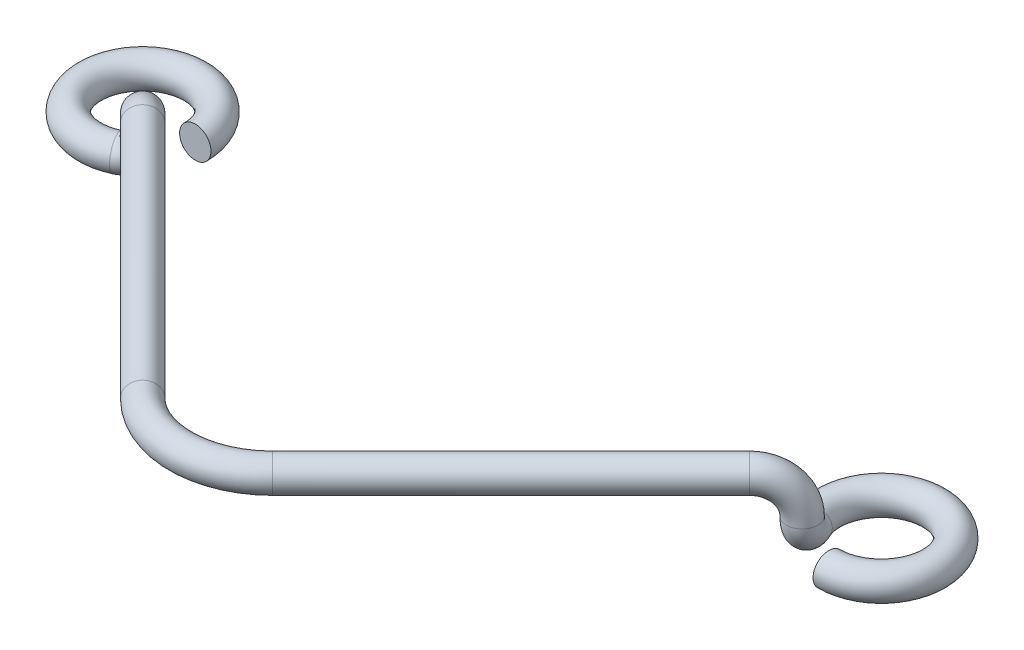
ISO-10303-21;
HEADER;
FILE_DESCRIPTION(('STEP AP214'),'2;1');
FILE_NAME('part.step','',(''),(''),'','','');
FILE_SCHEMA(('AUTOMOTIVE_DESIGN { 1 0 10303 214 1 1 1 1 }'));
ENDSEC;
DATA;
#1=APPLICATION_CONTEXT('core data for automotive mechanical design processes');
#2=APPLICATION_PROTOCOL_DEFINITION('international standard','automotive_design',2000,#1);
#3=PRODUCT_CONTEXT('',#1,'mechanical');
#4=PRODUCT('Part','Part','',(#3));
#5=PRODUCT_RELATED_PRODUCT_CATEGORY('part','',(#4));
#6=PRODUCT_DEFINITION_FORMATION('','',#4);
#7=PRODUCT_DEFINITION_CONTEXT('part definition',#1,'design');
#8=PRODUCT_DEFINITION('design','',#6,#7);
#9=PRODUCT_DEFINITION_SHAPE('','',#8);
#10=(LENGTH_UNIT() NAMED_UNIT(*) SI_UNIT(.MILLI.,.METRE.));
#11=(NAMED_UNIT(*) PLANE_ANGLE_UNIT() SI_UNIT($,.RADIAN.));
#12=(NAMED_UNIT(*) SI_UNIT($,.STERADIAN.) SOLID_ANGLE_UNIT());
#13=UNCERTAINTY_MEASURE_WITH_UNIT(LENGTH_MEASURE(1.E-05),#10,'distance_accuracy_value','');
#14=(GEOMETRIC_REPRESENTATION_CONTEXT(3) GLOBAL_UNCERTAINTY_ASSIGNED_CONTEXT((#13)) GLOBAL_UNIT_ASSIGNED_CONTEXT((#10,
#11,#12)) REPRESENTATION_CONTEXT('',''));
#15=CARTESIAN_POINT('',(0.,0.,0.));
#16=DIRECTION('',(0.,0.,1.));
#17=DIRECTION('',(1.,0.,0.));
#18=AXIS2_PLACEMENT_3D('',#15,#16,#17);
#19=CARTESIAN_POINT('',(20.,0.,-20.));
#20=DIRECTION('',(0.,-1.,0.));
#21=DIRECTION('',(0.,0.,-1.));
#22=AXIS2_PLACEMENT_3D('',#19,#20,#21);
#23=TOROIDAL_SURFACE('',#22,2.85000000000002,0.85);
#24=CARTESIAN_POINT('',(17.4170228069455,0.,-18.795537954039));
#25=DIRECTION('',(0.422618261740722,0.,0.90630778703664));
#26=DIRECTION('',(-0.694272044014863,-0.642787609686546,0.323744370967097));
#27=AXIS2_PLACEMENT_3D('',#24,#25,#26);
#28=CIRCLE('',#27,0.85);
#29=CARTESIAN_POINT('',(16.6466611879643,0.,-18.4363124315595));
#30=VERTEX_POINT('',#29);
#31=EDGE_CURVE('E39',#30,#30,#28,.T.);
#32=CARTESIAN_POINT('',(19.9999999999999,0.,-17.15));
#33=DIRECTION('',(1.,0.,0.));
#34=DIRECTION('',(0.,-0.642787609686546,0.766044443118973));
#35=AXIS2_PLACEMENT_3D('',#32,#33,#34);
#36=CIRCLE('',#35,0.85);
#37=CARTESIAN_POINT('',(19.9999999999999,0.,-16.3));
#38=VERTEX_POINT('',#37);
#39=EDGE_CURVE('E10',#38,#38,#36,.T.);
#40=CARTESIAN_POINT('',(20.,0.,-20.));
#41=DIRECTION('',(0.,-1.,0.));
#42=DIRECTION('',(0.,0.,-1.));
#43=AXIS2_PLACEMENT_3D('',#40,#41,#42);
#44=CIRCLE('',#43,3.70000000000002);
#45=EDGE_CURVE('',#30,#38,#44,.T.);
#46=ORIENTED_EDGE('',*,*,#31,.F.);
#47=ORIENTED_EDGE('',*,*,#39,.T.);
#48=ORIENTED_EDGE('',*,*,#45,.T.);
#49=ORIENTED_EDGE('',*,*,#45,.F.);
#50=EDGE_LOOP('',(#46,#48,#47,#49));
#51=FACE_BOUND('',#50,.T.);
#52=ADVANCED_FACE('F33',(#51),#23,.T.);
#53=CARTESIAN_POINT('',(17.4170228069455,1.03731516765868,-18.795537954039));
#54=DIRECTION('',(0.906307787036649,0.,-0.422618261740702));
#55=DIRECTION('',(-0.422618261740702,0.,-0.906307787036649));
#56=AXIS2_PLACEMENT_3D('',#53,#54,#55);
#57=TOROIDAL_SURFACE('',#56,1.0373151676587,0.85);
#58=CARTESIAN_POINT('',(17.8554111399787,1.03731516765864,-17.8554111399787));
#59=DIRECTION('',(0.,1.,0.));
#60=DIRECTION('',(-0.42261826174069,0.,0.906307787036655));
#61=AXIS2_PLACEMENT_3D('',#58,#59,#60);
#62=CIRCLE('',#61,0.85);
#63=CARTESIAN_POINT('',(18.4564519039873,1.03731516765859,-18.4564519039873));
#64=VERTEX_POINT('',#63);
#65=EDGE_CURVE('E43',#64,#64,#62,.T.);
#66=ORIENTED_EDGE('',*,*,#65,.F.);
#67=EDGE_LOOP('',(#66));
#68=FACE_BOUND('',#67,.T.);
#69=ORIENTED_EDGE('',*,*,#31,.T.);
#70=EDGE_LOOP('',(#69));
#71=FACE_BOUND('',#70,.T.);
#72=ADVANCED_FACE('F89',(#68,#71),#57,.T.);
#73=CARTESIAN_POINT('',(16.4317542447342,1.03731516765876,-16.4317542447342));
#74=DIRECTION('',(-0.707106781186547,0.,-0.707106781186548));
#75=DIRECTION('',(-0.707106781186548,0.,0.707106781186547));
#76=AXIS2_PLACEMENT_3D('',#73,#74,#75);
#77=TOROIDAL_SURFACE('',#76,2.01335488942079,0.85);
#78=CARTESIAN_POINT('',(16.4317542447342,3.05067005707954,-16.4317542447342));
#79=DIRECTION('',(-0.707106781186561,0.,0.707106781186534));
#80=DIRECTION('',(0.241844762647985,-0.939692620785904,0.241844762647984));
#81=AXIS2_PLACEMENT_3D('',#78,#79,#80);
#82=CIRCLE('',#81,0.85);
#83=CARTESIAN_POINT('',(16.4317542447342,3.90067005707954,-16.4317542447342));
#84=VERTEX_POINT('',#83);
#85=EDGE_CURVE('E47',#84,#84,#82,.T.);
#86=CARTESIAN_POINT('',(16.4317542447342,1.03731516765876,-16.4317542447342));
#87=DIRECTION('',(-0.707106781186547,0.,-0.707106781186548));
#88=DIRECTION('',(-0.707106781186548,0.,0.707106781186547));
#89=AXIS2_PLACEMENT_3D('',#86,#87,#88);
#90=CIRCLE('',#89,2.86335488942079);
#91=EDGE_CURVE('',#84,#64,#90,.T.);
#92=ORIENTED_EDGE('',*,*,#85,.F.);
#93=ORIENTED_EDGE('',*,*,#65,.T.);
#94=ORIENTED_EDGE('',*,*,#91,.T.);
#95=ORIENTED_EDGE('',*,*,#91,.F.);
#96=EDGE_LOOP('',(#92,#94,#93,#95));
#97=FACE_BOUND('',#96,.T.);
#98=ADVANCED_FACE('F94',(#97),#77,.T.);
#99=CARTESIAN_POINT('',(3.5145528489193,3.05067005707955,-3.51455284891938));
#100=DIRECTION('',(0.70710678118655,0.,-0.707106781186545));
#101=DIRECTION('',(-0.707106781186545,0.,-0.70710678118655));
#102=AXIS2_PLACEMENT_3D('',#99,#100,#101);
#103=CYLINDRICAL_SURFACE('',#102,0.85);
#104=CARTESIAN_POINT('',(3.5145528489193,3.05067005707955,-3.51455284891938));
#105=DIRECTION('',(-0.707106781186561,0.,0.707106781186534));
#106=DIRECTION('',(0.241844762647985,-0.939692620785904,0.241844762647984));
#107=AXIS2_PLACEMENT_3D('',#104,#105,#106);
#108=CIRCLE('',#107,0.85);
#109=CARTESIAN_POINT('',(4.11559361292787,3.05067005707955,-2.91351208491082));
#110=VERTEX_POINT('',#109);
#111=EDGE_CURVE('E52',#110,#110,#108,.T.);
#112=ORIENTED_EDGE('',*,*,#111,.F.);
#113=EDGE_LOOP('',(#112));
#114=FACE_BOUND('',#113,.T.);
#115=ORIENTED_EDGE('',*,*,#85,.T.);
#116=EDGE_LOOP('',(#115));
#117=FACE_BOUND('',#116,.T.);
#118=ADVANCED_FACE('F99',(#114,#117),#103,.T.);
#119=CARTESIAN_POINT('',(0.,3.05067005707955,-7.02910569783862));
#120=DIRECTION('',(0.,1.,0.));
#121=DIRECTION('',(0.,0.,1.));
#122=AXIS2_PLACEMENT_3D('',#119,#120,#121);
#123=TOROIDAL_SURFACE('',#122,4.97032830461864,0.85);
#124=CARTESIAN_POINT('',(-3.51455284891924,3.05067005707955,-3.51455284891932));
#125=DIRECTION('',(-0.707106781186535,0.,-0.70710678118656));
#126=DIRECTION('',(-0.241844762647984,-0.939692620785904,0.241844762647985));
#127=AXIS2_PLACEMENT_3D('',#124,#125,#126);
#128=CIRCLE('',#127,0.85);
#129=CARTESIAN_POINT('',(-4.11559361292781,3.05067005707955,-2.91351208491075));
#130=VERTEX_POINT('',#129);
#131=EDGE_CURVE('E55',#130,#130,#128,.T.);
#132=CARTESIAN_POINT('',(0.,3.05067005707955,-7.02910569783862));
#133=DIRECTION('',(0.,1.,0.));
#134=DIRECTION('',(0.,0.,1.));
#135=AXIS2_PLACEMENT_3D('',#132,#133,#134);
#136=CIRCLE('',#135,5.82032830461864);
#137=EDGE_CURVE('',#130,#110,#136,.T.);
#138=ORIENTED_EDGE('',*,*,#131,.F.);
#139=ORIENTED_EDGE('',*,*,#111,.T.);
#140=ORIENTED_EDGE('',*,*,#137,.T.);
#141=ORIENTED_EDGE('',*,*,#137,.F.);
#142=EDGE_LOOP('',(#138,#140,#139,#141));
#143=FACE_BOUND('',#142,.T.);
#144=ADVANCED_FACE('F106',(#143),#123,.T.);
#145=CARTESIAN_POINT('',(-16.431754244734,3.05067005707958,-16.4317542447341));
#146=DIRECTION('',(0.707106781186548,0.,0.707106781186547));
#147=DIRECTION('',(0.707106781186547,0.,-0.707106781186548));
#148=AXIS2_PLACEMENT_3D('',#145,#146,#147);
#149=CYLINDRICAL_SURFACE('',#148,0.85);
#150=CARTESIAN_POINT('',(-16.431754244734,3.05067005707958,-16.4317542447341));
#151=DIRECTION('',(-0.707106781186535,0.,-0.70710678118656));
#152=DIRECTION('',(-0.241844762647984,-0.939692620785904,0.241844762647985));
#153=AXIS2_PLACEMENT_3D('',#150,#151,#152);
#154=CIRCLE('',#153,0.85);
#155=CARTESIAN_POINT('',(-16.431754244734,3.90067005707957,-16.4317542447341));
#156=VERTEX_POINT('',#155);
#157=EDGE_CURVE('E58',#156,#156,#154,.T.);
#158=ORIENTED_EDGE('',*,*,#157,.F.);
#159=EDGE_LOOP('',(#158));
#160=FACE_BOUND('',#159,.T.);
#161=ORIENTED_EDGE('',*,*,#131,.T.);
#162=EDGE_LOOP('',(#161));
#163=FACE_BOUND('',#162,.T.);
#164=ADVANCED_FACE('F110',(#160,#163),#149,.T.);
#165=CARTESIAN_POINT('',(-16.4317542447341,1.03731516765866,-16.4317542447341));
#166=DIRECTION('',(0.707106781186547,0.,-0.707106781186548));
#167=DIRECTION('',(-0.707106781186548,0.,-0.707106781186547));
#168=AXIS2_PLACEMENT_3D('',#165,#166,#167);
#169=TOROIDAL_SURFACE('',#168,2.01335488942091,0.85);
#170=CARTESIAN_POINT('',(-17.8554111399787,1.0373151676587,-17.8554111399787));
#171=DIRECTION('',(0.,-1.,0.));
#172=DIRECTION('',(0.422618261740708,0.,0.906307787036646));
#173=AXIS2_PLACEMENT_3D('',#170,#171,#172);
#174=CIRCLE('',#173,0.85);
#175=CARTESIAN_POINT('',(-18.4564519039873,1.03731516765871,-18.4564519039873));
#176=VERTEX_POINT('',#175);
#177=EDGE_CURVE('E61',#176,#176,#174,.T.);
#178=CARTESIAN_POINT('',(-16.4317542447341,1.03731516765866,-16.4317542447341));
#179=DIRECTION('',(0.707106781186547,0.,-0.707106781186548));
#180=DIRECTION('',(-0.707106781186548,0.,-0.707106781186547));
#181=AXIS2_PLACEMENT_3D('',#178,#179,#180);
#182=CIRCLE('',#181,2.86335488942091);
#183=EDGE_CURVE('',#176,#156,#182,.T.);
#184=ORIENTED_EDGE('',*,*,#177,.F.);
#185=ORIENTED_EDGE('',*,*,#157,.T.);
#186=ORIENTED_EDGE('',*,*,#183,.T.);
#187=ORIENTED_EDGE('',*,*,#183,.F.);
#188=EDGE_LOOP('',(#184,#186,#185,#187));
#189=FACE_BOUND('',#188,.T.);
#190=ADVANCED_FACE('F85',(#189),#169,.T.);
#191=CARTESIAN_POINT('',(-18.795537954039,1.03731516765865,-17.4170228069456));
#192=DIRECTION('',(0.422618261740708,0.,0.906307787036646));
#193=DIRECTION('',(0.906307787036646,0.,-0.422618261740708));
#194=AXIS2_PLACEMENT_3D('',#191,#192,#193);
#195=TOROIDAL_SURFACE('',#194,1.03731516765865,0.85);
#196=CARTESIAN_POINT('',(-18.795537954039,0.,-17.4170228069456));
#197=DIRECTION('',(-0.906307787036641,0.,0.422618261740719));
#198=DIRECTION('',(0.422618261740719,0.,0.906307787036641));
#199=AXIS2_PLACEMENT_3D('',#196,#197,#198);
#200=CIRCLE('',#199,0.85);
#201=CARTESIAN_POINT('',(-18.4363124315593,0.,-16.6466611879644));
#202=VERTEX_POINT('',#201);
#203=EDGE_CURVE('E64',#202,#202,#200,.T.);
#204=ORIENTED_EDGE('',*,*,#203,.F.);
#205=EDGE_LOOP('',(#204));
#206=FACE_BOUND('',#205,.T.);
#207=ORIENTED_EDGE('',*,*,#177,.T.);
#208=EDGE_LOOP('',(#207));
#209=FACE_BOUND('',#208,.T.);
#210=ADVANCED_FACE('F76',(#206,#209),#195,.T.);
#211=CARTESIAN_POINT('',(-20.,0.,-20.));
#212=DIRECTION('',(0.,-1.,0.));
#213=DIRECTION('',(0.,0.,-1.));
#214=AXIS2_PLACEMENT_3D('',#211,#212,#213);
#215=TOROIDAL_SURFACE('',#214,2.85,0.85);
#216=CARTESIAN_POINT('',(-17.15,0.,-20.));
#217=DIRECTION('',(0.,0.,1.));
#218=DIRECTION('',(1.,0.,0.));
#219=AXIS2_PLACEMENT_3D('',#216,#217,#218);
#220=CIRCLE('',#219,0.85);
#221=CARTESIAN_POINT('',(-16.3,0.,-20.));
#222=VERTEX_POINT('',#221);
#223=EDGE_CURVE('E67',#222,#222,#220,.T.);
#224=CARTESIAN_POINT('',(-20.,0.,-20.));
#225=DIRECTION('',(0.,-1.,0.));
#226=DIRECTION('',(0.,0.,-1.));
#227=AXIS2_PLACEMENT_3D('',#224,#225,#226);
#228=CIRCLE('',#227,3.7);
#229=EDGE_CURVE('',#202,#222,#228,.T.);
#230=ORIENTED_EDGE('',*,*,#203,.T.);
#231=ORIENTED_EDGE('',*,*,#223,.F.);
#232=ORIENTED_EDGE('',*,*,#229,.T.);
#233=ORIENTED_EDGE('',*,*,#229,.F.);
#234=EDGE_LOOP('',(#230,#232,#231,#233));
#235=FACE_BOUND('',#234,.T.);
#236=ADVANCED_FACE('F73',(#235),#215,.T.);
#237=CARTESIAN_POINT('',(19.9999999999999,0.,-17.15));
#238=DIRECTION('',(1.,0.,0.));
#239=DIRECTION('',(0.,-0.642787609686546,0.766044443118973));
#240=AXIS2_PLACEMENT_3D('',#237,#238,#239);
#241=PLANE('',#240);
#242=ORIENTED_EDGE('',*,*,#39,.F.);
#243=EDGE_LOOP('',(#242));
#244=FACE_BOUND('',#243,.T.);
#245=ADVANCED_FACE('F75',(#244),#241,.F.);
#246=CARTESIAN_POINT('',(-17.15,0.,-20.));
#247=DIRECTION('',(0.,0.,1.));
#248=DIRECTION('',(1.,0.,0.));
#249=AXIS2_PLACEMENT_3D('',#246,#247,#248);
#250=PLANE('',#249);
#251=ORIENTED_EDGE('',*,*,#223,.T.);
#252=EDGE_LOOP('',(#251));
#253=FACE_BOUND('',#252,.T.);
#254=ADVANCED_FACE('F71',(#253),#250,.T.);
#255=CLOSED_SHELL('',(#52,#72,#98,#118,#144,#164,#190,#210,#236,#245,#254));
#256=MANIFOLD_SOLID_BREP('B2',#255);
#257=ADVANCED_BREP_SHAPE_REPRESENTATION('',(#18,#256),#14);
#258=SHAPE_DEFINITION_REPRESENTATION(#9,#257);
ENDSEC;
END-ISO-10303-21;
